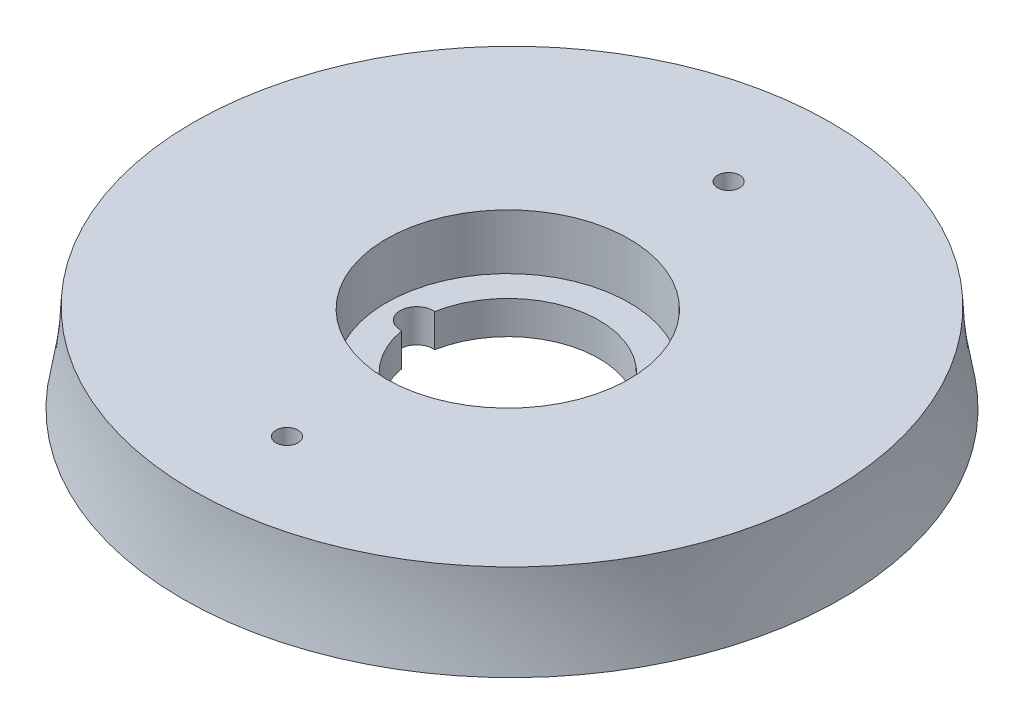
ISO-10303-21;
HEADER;
FILE_DESCRIPTION(('STEP AP214'),'2;1');
FILE_NAME('part.step','',(''),(''),'','','');
FILE_SCHEMA(('AUTOMOTIVE_DESIGN { 1 0 10303 214 1 1 1 1 }'));
ENDSEC;
DATA;
#1=APPLICATION_CONTEXT('core data for automotive mechanical design processes');
#2=APPLICATION_PROTOCOL_DEFINITION('international standard','automotive_design',2000,#1);
#3=PRODUCT_CONTEXT('',#1,'mechanical');
#4=PRODUCT('Part','Part','',(#3));
#5=PRODUCT_RELATED_PRODUCT_CATEGORY('part','',(#4));
#6=PRODUCT_DEFINITION_FORMATION('','',#4);
#7=PRODUCT_DEFINITION_CONTEXT('part definition',#1,'design');
#8=PRODUCT_DEFINITION('design','',#6,#7);
#9=PRODUCT_DEFINITION_SHAPE('','',#8);
#10=(LENGTH_UNIT() NAMED_UNIT(*) SI_UNIT(.MILLI.,.METRE.));
#11=(NAMED_UNIT(*) PLANE_ANGLE_UNIT() SI_UNIT($,.RADIAN.));
#12=(NAMED_UNIT(*) SI_UNIT($,.STERADIAN.) SOLID_ANGLE_UNIT());
#13=UNCERTAINTY_MEASURE_WITH_UNIT(LENGTH_MEASURE(1.E-05),#10,'distance_accuracy_value','');
#14=(GEOMETRIC_REPRESENTATION_CONTEXT(3) GLOBAL_UNCERTAINTY_ASSIGNED_CONTEXT((#13)) GLOBAL_UNIT_ASSIGNED_CONTEXT((#10,
#11,#12)) REPRESENTATION_CONTEXT('',''));
#15=CARTESIAN_POINT('',(0.,0.,0.));
#16=DIRECTION('',(0.,0.,1.));
#17=DIRECTION('',(1.,0.,0.));
#18=AXIS2_PLACEMENT_3D('',#15,#16,#17);
#19=CARTESIAN_POINT('',(0.,2.09785264082302,0.));
#20=DIRECTION('',(0.,1.,0.));
#21=DIRECTION('',(0.,0.,1.));
#22=AXIS2_PLACEMENT_3D('',#19,#20,#21);
#23=CYLINDRICAL_SURFACE('',#22,8.25);
#24=CARTESIAN_POINT('',(0.,5.09885264082296,0.));
#25=DIRECTION('',(0.,1.,0.));
#26=DIRECTION('',(0.,0.,1.));
#27=AXIS2_PLACEMENT_3D('',#24,#25,#26);
#28=CIRCLE('',#27,8.25);
#29=CARTESIAN_POINT('',(-8.11363636363637,5.09885264082296,1.4937887931959));
#30=VERTEX_POINT('',#29);
#31=CARTESIAN_POINT('',(-8.11363636363637,5.09885264082296,-1.4937887931959));
#32=VERTEX_POINT('',#31);
#33=EDGE_CURVE('E70',#30,#32,#28,.T.);
#34=ORIENTED_EDGE('',*,*,#33,.T.);
#35=DIRECTION('',(0.,1.,0.));
#36=VECTOR('',#35,1.);
#37=CARTESIAN_POINT('',(-8.11363636363637,2.09785264082302,-1.4937887931959));
#38=LINE('',#37,#36);
#39=CARTESIAN_POINT('',(-8.11363636363637,2.09885264082302,-1.49378879319591));
#40=VERTEX_POINT('',#39);
#41=EDGE_CURVE('E49',#40,#32,#38,.T.);
#42=ORIENTED_EDGE('',*,*,#41,.F.);
#43=CARTESIAN_POINT('',(0.,2.09885264082302,0.));
#44=DIRECTION('',(0.,1.,0.));
#45=DIRECTION('',(0.,0.,1.));
#46=AXIS2_PLACEMENT_3D('',#43,#44,#45);
#47=CIRCLE('',#46,8.25);
#48=CARTESIAN_POINT('',(-8.11363636363637,2.09885264082302,1.4937887931959));
#49=VERTEX_POINT('',#48);
#50=EDGE_CURVE('E68',#40,#49,#47,.F.);
#51=ORIENTED_EDGE('',*,*,#50,.T.);
#52=DIRECTION('',(0.,1.,0.));
#53=VECTOR('',#52,1.);
#54=CARTESIAN_POINT('',(-8.11363636363637,2.09785264082302,1.4937887931959));
#55=LINE('',#54,#53);
#56=EDGE_CURVE('E54',#49,#30,#55,.T.);
#57=ORIENTED_EDGE('',*,*,#56,.T.);
#58=EDGE_LOOP('',(#34,#42,#51,#57));
#59=FACE_BOUND('',#58,.T.);
#60=ADVANCED_FACE('F33',(#59),#23,.F.);
#61=CARTESIAN_POINT('',(0.,10.098852640823,0.));
#62=DIRECTION('',(0.,-1.,0.));
#63=DIRECTION('',(0.,0.,-1.));
#64=AXIS2_PLACEMENT_3D('',#61,#62,#63);
#65=PLANE('',#64);
#66=CARTESIAN_POINT('',(0.,10.098852640823,0.));
#67=DIRECTION('',(0.,1.,0.));
#68=DIRECTION('',(0.,0.,1.));
#69=AXIS2_PLACEMENT_3D('',#66,#67,#68);
#70=CIRCLE('',#69,11.);
#71=CARTESIAN_POINT('',(0.,10.098852640823,11.));
#72=VERTEX_POINT('',#71);
#73=EDGE_CURVE('E64',#72,#72,#70,.T.);
#74=ORIENTED_EDGE('',*,*,#73,.F.);
#75=EDGE_LOOP('',(#74));
#76=FACE_BOUND('',#75,.T.);
#77=CARTESIAN_POINT('',(0.,10.098852640823,-20.));
#78=DIRECTION('',(0.,1.,0.));
#79=DIRECTION('',(0.,0.,1.));
#80=AXIS2_PLACEMENT_3D('',#77,#78,#79);
#81=CIRCLE('',#80,1.);
#82=CARTESIAN_POINT('',(0.,10.098852640823,-19.));
#83=VERTEX_POINT('',#82);
#84=EDGE_CURVE('E81',#83,#83,#81,.T.);
#85=ORIENTED_EDGE('',*,*,#84,.F.);
#86=EDGE_LOOP('',(#85));
#87=FACE_BOUND('',#86,.T.);
#88=CARTESIAN_POINT('',(0.,10.098852640823,-0.38020945273937));
#89=DIRECTION('',(0.,-1.,0.));
#90=DIRECTION('',(0.,0.,-1.));
#91=AXIS2_PLACEMENT_3D('',#88,#89,#90);
#92=CIRCLE('',#91,28.8802398884298);
#93=CARTESIAN_POINT('',(0.,10.098852640823,-29.2604493411692));
#94=VERTEX_POINT('',#93);
#95=EDGE_CURVE('E11',#94,#94,#92,.T.);
#96=ORIENTED_EDGE('',*,*,#95,.F.);
#97=EDGE_LOOP('',(#96));
#98=FACE_BOUND('',#97,.T.);
#99=CARTESIAN_POINT('',(0.,10.098852640823,20.));
#100=DIRECTION('',(0.,1.,0.));
#101=DIRECTION('',(0.,0.,1.));
#102=AXIS2_PLACEMENT_3D('',#99,#100,#101);
#103=CIRCLE('',#102,1.);
#104=CARTESIAN_POINT('',(0.,10.098852640823,21.));
#105=VERTEX_POINT('',#104);
#106=EDGE_CURVE('E89',#105,#105,#103,.F.);
#107=ORIENTED_EDGE('',*,*,#106,.T.);
#108=EDGE_LOOP('',(#107));
#109=FACE_BOUND('',#108,.T.);
#110=ADVANCED_FACE('F109',(#76,#87,#98,#109),#65,.F.);
#111=CARTESIAN_POINT('',(0.,2.09885264082302,0.));
#112=DIRECTION('',(0.,1.,0.));
#113=DIRECTION('',(0.,0.,1.));
#114=AXIS2_PLACEMENT_3D('',#111,#112,#113);
#115=PLANE('',#114);
#116=ORIENTED_EDGE('',*,*,#50,.F.);
#117=CARTESIAN_POINT('',(-8.25,2.09885264082302,0.));
#118=DIRECTION('',(0.,1.,0.));
#119=DIRECTION('',(0.,0.,1.));
#120=AXIS2_PLACEMENT_3D('',#117,#118,#119);
#121=CIRCLE('',#120,1.5);
#122=EDGE_CURVE('E59',#49,#40,#121,.F.);
#123=ORIENTED_EDGE('',*,*,#122,.F.);
#124=EDGE_LOOP('',(#116,#123));
#125=FACE_BOUND('',#124,.T.);
#126=CARTESIAN_POINT('',(0.,2.09885264082302,-20.));
#127=DIRECTION('',(0.,1.,0.));
#128=DIRECTION('',(0.,0.,1.));
#129=AXIS2_PLACEMENT_3D('',#126,#127,#128);
#130=CIRCLE('',#129,1.);
#131=CARTESIAN_POINT('',(0.,2.09885264082302,-19.));
#132=VERTEX_POINT('',#131);
#133=EDGE_CURVE('E85',#132,#132,#130,.F.);
#134=ORIENTED_EDGE('',*,*,#133,.F.);
#135=EDGE_LOOP('',(#134));
#136=FACE_BOUND('',#135,.T.);
#137=CARTESIAN_POINT('',(0.,2.09885264082302,-0.38020945273937));
#138=DIRECTION('',(0.,-1.,0.));
#139=DIRECTION('',(0.,0.,-1.));
#140=AXIS2_PLACEMENT_3D('',#137,#138,#139);
#141=CIRCLE('',#140,29.8496231131986);
#142=CARTESIAN_POINT('',(0.,2.09885264082302,-30.229832565938));
#143=VERTEX_POINT('',#142);
#144=EDGE_CURVE('E42',#143,#143,#141,.T.);
#145=ORIENTED_EDGE('',*,*,#144,.T.);
#146=EDGE_LOOP('',(#145));
#147=FACE_BOUND('',#146,.T.);
#148=CARTESIAN_POINT('',(0.,2.09885264082302,20.));
#149=DIRECTION('',(0.,1.,0.));
#150=DIRECTION('',(0.,0.,1.));
#151=AXIS2_PLACEMENT_3D('',#148,#149,#150);
#152=CIRCLE('',#151,1.);
#153=CARTESIAN_POINT('',(0.,2.09885264082302,21.));
#154=VERTEX_POINT('',#153);
#155=EDGE_CURVE('E88',#154,#154,#152,.T.);
#156=ORIENTED_EDGE('',*,*,#155,.T.);
#157=EDGE_LOOP('',(#156));
#158=FACE_BOUND('',#157,.T.);
#159=ADVANCED_FACE('F72',(#125,#136,#147,#158),#115,.F.);
#160=CARTESIAN_POINT('',(0.,20.098852640823,-30.229832565938));
#161=CARTESIAN_POINT('',(0.,13.3241995111587,-28.7980568454791));
#162=CARTESIAN_POINT('',(0.,7.98026999970867,-29.0428490569546));
#163=CARTESIAN_POINT('',(0.,2.09885264082302,-30.229832565938));
#164=B_SPLINE_CURVE_WITH_KNOTS('',3,(#160,#161,#162,#163),.UNSPECIFIED.,.F.,.F.,(4,4),(0.,1.),.UNSPECIFIED.);
#165=CARTESIAN_POINT('',(0.,5.09885264082302,-0.38020945273937));
#166=DIRECTION('',(0.,-1.,0.));
#167=AXIS1_PLACEMENT('',#165,#166);
#168=SURFACE_OF_REVOLUTION('',#164,#167);
#169=ORIENTED_EDGE('',*,*,#144,.F.);
#170=EDGE_LOOP('',(#169));
#171=FACE_BOUND('',#170,.T.);
#172=ORIENTED_EDGE('',*,*,#95,.T.);
#173=EDGE_LOOP('',(#172));
#174=FACE_BOUND('',#173,.T.);
#175=ADVANCED_FACE('F35',(#171,#174),#168,.T.);
#176=CARTESIAN_POINT('',(0.,2.09785264082302,20.));
#177=DIRECTION('',(0.,1.,0.));
#178=DIRECTION('',(0.,0.,1.));
#179=AXIS2_PLACEMENT_3D('',#176,#177,#178);
#180=CYLINDRICAL_SURFACE('',#179,1.);
#181=ORIENTED_EDGE('',*,*,#106,.F.);
#182=EDGE_LOOP('',(#181));
#183=FACE_BOUND('',#182,.T.);
#184=ORIENTED_EDGE('',*,*,#155,.F.);
#185=EDGE_LOOP('',(#184));
#186=FACE_BOUND('',#185,.T.);
#187=ADVANCED_FACE('F106',(#183,#186),#180,.F.);
#188=CARTESIAN_POINT('',(0.,2.09785264082302,-20.));
#189=DIRECTION('',(0.,1.,0.));
#190=DIRECTION('',(0.,0.,1.));
#191=AXIS2_PLACEMENT_3D('',#188,#189,#190);
#192=CYLINDRICAL_SURFACE('',#191,1.);
#193=ORIENTED_EDGE('',*,*,#84,.T.);
#194=EDGE_LOOP('',(#193));
#195=FACE_BOUND('',#194,.T.);
#196=ORIENTED_EDGE('',*,*,#133,.T.);
#197=EDGE_LOOP('',(#196));
#198=FACE_BOUND('',#197,.T.);
#199=ADVANCED_FACE('F117',(#195,#198),#192,.F.);
#200=CARTESIAN_POINT('',(0.,5.09885264082296,0.));
#201=DIRECTION('',(0.,1.,0.));
#202=DIRECTION('',(0.,0.,1.));
#203=AXIS2_PLACEMENT_3D('',#200,#201,#202);
#204=CYLINDRICAL_SURFACE('',#203,11.);
#205=CARTESIAN_POINT('',(0.,5.09885264082296,0.));
#206=DIRECTION('',(0.,1.,0.));
#207=DIRECTION('',(0.,0.,1.));
#208=AXIS2_PLACEMENT_3D('',#205,#206,#207);
#209=CIRCLE('',#208,11.);
#210=CARTESIAN_POINT('',(0.,5.09885264082296,11.));
#211=VERTEX_POINT('',#210);
#212=EDGE_CURVE('E74',#211,#211,#209,.T.);
#213=ORIENTED_EDGE('',*,*,#212,.F.);
#214=EDGE_LOOP('',(#213));
#215=FACE_BOUND('',#214,.T.);
#216=ORIENTED_EDGE('',*,*,#73,.T.);
#217=EDGE_LOOP('',(#216));
#218=FACE_BOUND('',#217,.T.);
#219=ADVANCED_FACE('F132',(#215,#218),#204,.F.);
#220=CARTESIAN_POINT('',(0.,5.09885264082296,0.));
#221=DIRECTION('',(0.,1.,0.));
#222=DIRECTION('',(0.,0.,1.));
#223=AXIS2_PLACEMENT_3D('',#220,#221,#222);
#224=PLANE('',#223);
#225=ORIENTED_EDGE('',*,*,#33,.F.);
#226=CARTESIAN_POINT('',(-8.25,5.09885264082296,0.));
#227=DIRECTION('',(0.,1.,0.));
#228=DIRECTION('',(0.,0.,1.));
#229=AXIS2_PLACEMENT_3D('',#226,#227,#228);
#230=CIRCLE('',#229,1.5);
#231=EDGE_CURVE('E77',#32,#30,#230,.T.);
#232=ORIENTED_EDGE('',*,*,#231,.F.);
#233=EDGE_LOOP('',(#225,#232));
#234=FACE_BOUND('',#233,.T.);
#235=ORIENTED_EDGE('',*,*,#212,.T.);
#236=EDGE_LOOP('',(#235));
#237=FACE_BOUND('',#236,.T.);
#238=ADVANCED_FACE('F139',(#234,#237),#224,.T.);
#239=CARTESIAN_POINT('',(-8.25,2.09785264082302,0.));
#240=DIRECTION('',(0.,1.,0.));
#241=DIRECTION('',(0.,0.,1.));
#242=AXIS2_PLACEMENT_3D('',#239,#240,#241);
#243=CYLINDRICAL_SURFACE('',#242,1.5);
#244=ORIENTED_EDGE('',*,*,#122,.T.);
#245=ORIENTED_EDGE('',*,*,#41,.T.);
#246=ORIENTED_EDGE('',*,*,#231,.T.);
#247=ORIENTED_EDGE('',*,*,#56,.F.);
#248=EDGE_LOOP('',(#244,#245,#246,#247));
#249=FACE_BOUND('',#248,.T.);
#250=ADVANCED_FACE('F60',(#249),#243,.F.);
#251=CLOSED_SHELL('',(#60,#110,#159,#175,#187,#199,#219,#238,#250));
#252=MANIFOLD_SOLID_BREP('B2',#251);
#253=ADVANCED_BREP_SHAPE_REPRESENTATION('',(#18,#252),#14);
#254=SHAPE_DEFINITION_REPRESENTATION(#9,#253);
ENDSEC;
END-ISO-10303-21;
